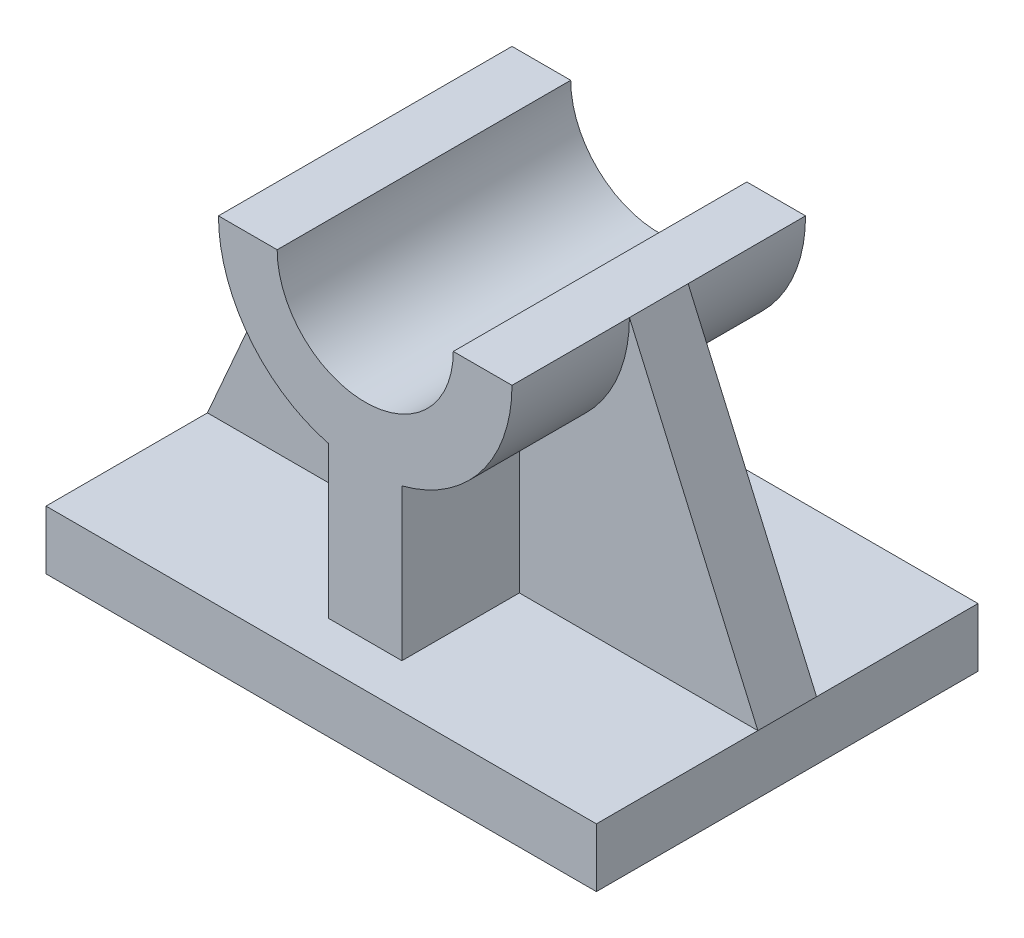
ISO-10303-21;
HEADER;
FILE_DESCRIPTION(('STEP AP214'),'2;1');
FILE_NAME('part.step','',(''),(''),'','','');
FILE_SCHEMA(('AUTOMOTIVE_DESIGN { 1 0 10303 214 1 1 1 1 }'));
ENDSEC;
DATA;
#1=APPLICATION_CONTEXT('core data for automotive mechanical design processes');
#2=APPLICATION_PROTOCOL_DEFINITION('international standard','automotive_design',2000,#1);
#3=PRODUCT_CONTEXT('',#1,'mechanical');
#4=PRODUCT('Part','Part','',(#3));
#5=PRODUCT_RELATED_PRODUCT_CATEGORY('part','',(#4));
#6=PRODUCT_DEFINITION_FORMATION('','',#4);
#7=PRODUCT_DEFINITION_CONTEXT('part definition',#1,'design');
#8=PRODUCT_DEFINITION('design','',#6,#7);
#9=PRODUCT_DEFINITION_SHAPE('','',#8);
#10=(LENGTH_UNIT() NAMED_UNIT(*) SI_UNIT(.MILLI.,.METRE.));
#11=(NAMED_UNIT(*) PLANE_ANGLE_UNIT() SI_UNIT($,.RADIAN.));
#12=(NAMED_UNIT(*) SI_UNIT($,.STERADIAN.) SOLID_ANGLE_UNIT());
#13=UNCERTAINTY_MEASURE_WITH_UNIT(LENGTH_MEASURE(1.E-05),#10,'distance_accuracy_value','');
#14=(GEOMETRIC_REPRESENTATION_CONTEXT(3) GLOBAL_UNCERTAINTY_ASSIGNED_CONTEXT((#13)) GLOBAL_UNIT_ASSIGNED_CONTEXT((#10,
#11,#12)) REPRESENTATION_CONTEXT('',''));
#15=CARTESIAN_POINT('',(0.,0.,0.));
#16=DIRECTION('',(0.,0.,1.));
#17=DIRECTION('',(1.,0.,0.));
#18=AXIS2_PLACEMENT_3D('',#15,#16,#17);
#19=CARTESIAN_POINT('',(-37.5,4.,26.));
#20=DIRECTION('',(0.,1.,0.));
#21=DIRECTION('',(-1.,0.,0.));
#22=AXIS2_PLACEMENT_3D('',#19,#20,#21);
#23=PLANE('',#22);
#24=DIRECTION('',(0.,0.,-1.));
#25=VECTOR('',#24,1.);
#26=CARTESIAN_POINT('',(-37.5,4.,26.));
#27=LINE('',#26,#25);
#28=CARTESIAN_POINT('',(-37.5,4.,-3.99999999999999));
#29=VERTEX_POINT('',#28);
#30=CARTESIAN_POINT('',(-37.5,4.,-26.));
#31=VERTEX_POINT('',#30);
#32=EDGE_CURVE('E46',#29,#31,#27,.T.);
#33=ORIENTED_EDGE('',*,*,#32,.F.);
#34=DIRECTION('',(1.,0.,0.));
#35=VECTOR('',#34,1.);
#36=CARTESIAN_POINT('',(-37.5,4.,-4.));
#37=LINE('',#36,#35);
#38=CARTESIAN_POINT('',(-5.,4.,-4.));
#39=VERTEX_POINT('',#38);
#40=EDGE_CURVE('E189',#29,#39,#37,.T.);
#41=ORIENTED_EDGE('',*,*,#40,.T.);
#42=DIRECTION('',(0.,0.,-1.));
#43=VECTOR('',#42,1.);
#44=CARTESIAN_POINT('',(-4.99999999999999,4.,20.));
#45=LINE('',#44,#43);
#46=CARTESIAN_POINT('',(-4.99999999999999,4.,-20.));
#47=VERTEX_POINT('',#46);
#48=EDGE_CURVE('E176',#39,#47,#45,.T.);
#49=ORIENTED_EDGE('',*,*,#48,.T.);
#50=DIRECTION('',(1.,0.,0.));
#51=VECTOR('',#50,1.);
#52=CARTESIAN_POINT('',(0.,4.,-20.));
#53=LINE('',#52,#51);
#54=CARTESIAN_POINT('',(5.,4.,-20.));
#55=VERTEX_POINT('',#54);
#56=EDGE_CURVE('E264',#47,#55,#53,.T.);
#57=ORIENTED_EDGE('',*,*,#56,.T.);
#58=DIRECTION('',(0.,0.,-1.));
#59=VECTOR('',#58,1.);
#60=CARTESIAN_POINT('',(5.,4.,20.));
#61=LINE('',#60,#59);
#62=CARTESIAN_POINT('',(5.,4.,-4.));
#63=VERTEX_POINT('',#62);
#64=EDGE_CURVE('E289',#63,#55,#61,.T.);
#65=ORIENTED_EDGE('',*,*,#64,.F.);
#66=DIRECTION('',(1.,0.,0.));
#67=VECTOR('',#66,1.);
#68=CARTESIAN_POINT('',(-37.5,4.,-4.));
#69=LINE('',#68,#67);
#70=CARTESIAN_POINT('',(37.5,3.99999999999998,-4.));
#71=VERTEX_POINT('',#70);
#72=EDGE_CURVE('E222',#63,#71,#69,.T.);
#73=ORIENTED_EDGE('',*,*,#72,.T.);
#74=DIRECTION('',(0.,0.,-1.));
#75=VECTOR('',#74,1.);
#76=CARTESIAN_POINT('',(37.5,4.,26.));
#77=LINE('',#76,#75);
#78=CARTESIAN_POINT('',(37.5,4.,-26.));
#79=VERTEX_POINT('',#78);
#80=EDGE_CURVE('E313',#71,#79,#77,.T.);
#81=ORIENTED_EDGE('',*,*,#80,.T.);
#82=DIRECTION('',(1.,0.,0.));
#83=VECTOR('',#82,1.);
#84=CARTESIAN_POINT('',(-37.5,4.,-26.));
#85=LINE('',#84,#83);
#86=EDGE_CURVE('E306',#31,#79,#85,.T.);
#87=ORIENTED_EDGE('',*,*,#86,.F.);
#88=EDGE_LOOP('',(#33,#41,#49,#57,#65,#73,#81,#87));
#89=FACE_BOUND('',#88,.T.);
#90=ADVANCED_FACE('F37',(#89),#23,.T.);
#91=CARTESIAN_POINT('',(0.,44.,20.));
#92=DIRECTION('',(0.,0.,-1.));
#93=DIRECTION('',(-1.,0.,0.));
#94=AXIS2_PLACEMENT_3D('',#91,#92,#93);
#95=CYLINDRICAL_SURFACE('',#94,20.);
#96=CARTESIAN_POINT('',(0.,44.,-4.));
#97=DIRECTION('',(0.,0.,1.));
#98=DIRECTION('',(1.,0.,0.));
#99=AXIS2_PLACEMENT_3D('',#96,#97,#98);
#100=CIRCLE('',#99,20.);
#101=CARTESIAN_POINT('',(-20.,44.,-4.));
#102=VERTEX_POINT('',#101);
#103=CARTESIAN_POINT('',(-5.,24.6350832689629,-4.));
#104=VERTEX_POINT('',#103);
#105=EDGE_CURVE('E197',#102,#104,#100,.T.);
#106=ORIENTED_EDGE('',*,*,#105,.F.);
#107=DIRECTION('',(0.,0.,-1.));
#108=VECTOR('',#107,1.);
#109=CARTESIAN_POINT('',(-20.,44.,20.));
#110=LINE('',#109,#108);
#111=CARTESIAN_POINT('',(-20.,44.,-20.));
#112=VERTEX_POINT('',#111);
#113=EDGE_CURVE('E296',#102,#112,#110,.T.);
#114=ORIENTED_EDGE('',*,*,#113,.T.);
#115=CARTESIAN_POINT('',(0.,44.,-20.));
#116=DIRECTION('',(0.,0.,1.));
#117=DIRECTION('',(1.,0.,0.));
#118=AXIS2_PLACEMENT_3D('',#115,#116,#117);
#119=CIRCLE('',#118,20.);
#120=CARTESIAN_POINT('',(-5.,24.6350832689629,-20.));
#121=VERTEX_POINT('',#120);
#122=EDGE_CURVE('E260',#112,#121,#119,.T.);
#123=ORIENTED_EDGE('',*,*,#122,.T.);
#124=DIRECTION('',(0.,0.,-1.));
#125=VECTOR('',#124,1.);
#126=CARTESIAN_POINT('',(-5.,24.6350832689629,20.));
#127=LINE('',#126,#125);
#128=EDGE_CURVE('E292',#104,#121,#127,.T.);
#129=ORIENTED_EDGE('',*,*,#128,.F.);
#130=EDGE_LOOP('',(#106,#114,#123,#129));
#131=FACE_BOUND('',#130,.T.);
#132=ADVANCED_FACE('F349',(#131),#95,.T.);
#133=CARTESIAN_POINT('',(-4.99999999999999,0.,20.));
#134=DIRECTION('',(1.,0.,0.));
#135=DIRECTION('',(0.,1.,0.));
#136=AXIS2_PLACEMENT_3D('',#133,#134,#135);
#137=PLANE('',#136);
#138=DIRECTION('',(0.,-1.,0.));
#139=VECTOR('',#138,1.);
#140=CARTESIAN_POINT('',(-4.99999999999999,0.,-4.));
#141=LINE('',#140,#139);
#142=EDGE_CURVE('E179',#104,#39,#141,.T.);
#143=ORIENTED_EDGE('',*,*,#142,.F.);
#144=ORIENTED_EDGE('',*,*,#128,.T.);
#145=DIRECTION('',(0.,-1.,0.));
#146=VECTOR('',#145,1.);
#147=CARTESIAN_POINT('',(-4.99999999999999,0.,-20.));
#148=LINE('',#147,#146);
#149=EDGE_CURVE('E182',#121,#47,#148,.T.);
#150=ORIENTED_EDGE('',*,*,#149,.T.);
#151=ORIENTED_EDGE('',*,*,#48,.F.);
#152=EDGE_LOOP('',(#143,#144,#150,#151));
#153=FACE_BOUND('',#152,.T.);
#154=ADVANCED_FACE('F177',(#153),#137,.F.);
#155=CARTESIAN_POINT('',(5.,0.,20.));
#156=DIRECTION('',(1.,0.,0.));
#157=DIRECTION('',(0.,1.,0.));
#158=AXIS2_PLACEMENT_3D('',#155,#156,#157);
#159=PLANE('',#158);
#160=DIRECTION('',(0.,0.,-1.));
#161=VECTOR('',#160,1.);
#162=CARTESIAN_POINT('',(5.,24.6350832689629,20.));
#163=LINE('',#162,#161);
#164=CARTESIAN_POINT('',(5.,24.6350832689629,-4.));
#165=VERTEX_POINT('',#164);
#166=CARTESIAN_POINT('',(5.,24.6350832689629,-20.));
#167=VERTEX_POINT('',#166);
#168=EDGE_CURVE('E284',#165,#167,#163,.T.);
#169=ORIENTED_EDGE('',*,*,#168,.F.);
#170=DIRECTION('',(0.,-1.,0.));
#171=VECTOR('',#170,1.);
#172=CARTESIAN_POINT('',(5.,0.,-4.));
#173=LINE('',#172,#171);
#174=EDGE_CURVE('E219',#165,#63,#173,.T.);
#175=ORIENTED_EDGE('',*,*,#174,.T.);
#176=ORIENTED_EDGE('',*,*,#64,.T.);
#177=DIRECTION('',(0.,-1.,0.));
#178=VECTOR('',#177,1.);
#179=CARTESIAN_POINT('',(5.,0.,-20.));
#180=LINE('',#179,#178);
#181=EDGE_CURVE('E266',#167,#55,#180,.T.);
#182=ORIENTED_EDGE('',*,*,#181,.F.);
#183=EDGE_LOOP('',(#169,#175,#176,#182));
#184=FACE_BOUND('',#183,.T.);
#185=ADVANCED_FACE('F367',(#184),#159,.T.);
#186=CARTESIAN_POINT('',(0.,44.,20.));
#187=DIRECTION('',(0.,0.,-1.));
#188=DIRECTION('',(-1.,0.,0.));
#189=AXIS2_PLACEMENT_3D('',#186,#187,#188);
#190=CYLINDRICAL_SURFACE('',#189,20.);
#191=CARTESIAN_POINT('',(0.,44.,-4.));
#192=DIRECTION('',(0.,0.,1.));
#193=DIRECTION('',(1.,0.,0.));
#194=AXIS2_PLACEMENT_3D('',#191,#192,#193);
#195=CIRCLE('',#194,20.);
#196=CARTESIAN_POINT('',(20.,44.,-4.));
#197=VERTEX_POINT('',#196);
#198=EDGE_CURVE('E214',#165,#197,#195,.T.);
#199=ORIENTED_EDGE('',*,*,#198,.F.);
#200=ORIENTED_EDGE('',*,*,#168,.T.);
#201=CARTESIAN_POINT('',(0.,44.,-20.));
#202=DIRECTION('',(0.,0.,1.));
#203=DIRECTION('',(1.,0.,0.));
#204=AXIS2_PLACEMENT_3D('',#201,#202,#203);
#205=CIRCLE('',#204,20.);
#206=CARTESIAN_POINT('',(20.,44.,-20.));
#207=VERTEX_POINT('',#206);
#208=EDGE_CURVE('E269',#167,#207,#205,.T.);
#209=ORIENTED_EDGE('',*,*,#208,.T.);
#210=DIRECTION('',(0.,0.,-1.));
#211=VECTOR('',#210,1.);
#212=CARTESIAN_POINT('',(20.,44.,20.));
#213=LINE('',#212,#211);
#214=EDGE_CURVE('E280',#197,#207,#213,.T.);
#215=ORIENTED_EDGE('',*,*,#214,.F.);
#216=EDGE_LOOP('',(#199,#200,#209,#215));
#217=FACE_BOUND('',#216,.T.);
#218=ADVANCED_FACE('F361',(#217),#190,.T.);
#219=DIRECTION('',(1.,0.,0.));
#220=VECTOR('',#219,1.);
#221=CARTESIAN_POINT('',(-37.5,4.,4.));
#222=LINE('',#221,#220);
#223=CARTESIAN_POINT('',(-37.5,4.,4.00000000000001));
#224=VERTEX_POINT('',#223);
#225=CARTESIAN_POINT('',(-4.99999999999999,4.,4.));
#226=VERTEX_POINT('',#225);
#227=EDGE_CURVE('E61',#224,#226,#222,.T.);
#228=ORIENTED_EDGE('',*,*,#227,.F.);
#229=CARTESIAN_POINT('',(-37.5,4.,26.));
#230=VERTEX_POINT('',#229);
#231=EDGE_CURVE('E11',#230,#224,#27,.T.);
#232=ORIENTED_EDGE('',*,*,#231,.F.);
#233=DIRECTION('',(1.,0.,0.));
#234=VECTOR('',#233,1.);
#235=CARTESIAN_POINT('',(-4.99999999999999,4.,26.));
#236=LINE('',#235,#234);
#237=CARTESIAN_POINT('',(37.5,4.,26.));
#238=VERTEX_POINT('',#237);
#239=EDGE_CURVE('E302',#230,#238,#236,.T.);
#240=ORIENTED_EDGE('',*,*,#239,.T.);
#241=CARTESIAN_POINT('',(37.5,3.99999999999998,4.));
#242=VERTEX_POINT('',#241);
#243=EDGE_CURVE('E41',#238,#242,#77,.T.);
#244=ORIENTED_EDGE('',*,*,#243,.T.);
#245=DIRECTION('',(1.,0.,0.));
#246=VECTOR('',#245,1.);
#247=CARTESIAN_POINT('',(-37.5,4.,4.));
#248=LINE('',#247,#246);
#249=CARTESIAN_POINT('',(5.,4.,4.));
#250=VERTEX_POINT('',#249);
#251=EDGE_CURVE('E230',#250,#242,#248,.T.);
#252=ORIENTED_EDGE('',*,*,#251,.F.);
#253=CARTESIAN_POINT('',(5.,4.,20.));
#254=VERTEX_POINT('',#253);
#255=EDGE_CURVE('E186',#254,#250,#61,.T.);
#256=ORIENTED_EDGE('',*,*,#255,.F.);
#257=DIRECTION('',(1.,0.,0.));
#258=VECTOR('',#257,1.);
#259=CARTESIAN_POINT('',(0.,4.,20.));
#260=LINE('',#259,#258);
#261=CARTESIAN_POINT('',(-4.99999999999999,4.,20.));
#262=VERTEX_POINT('',#261);
#263=EDGE_CURVE('E244',#262,#254,#260,.T.);
#264=ORIENTED_EDGE('',*,*,#263,.F.);
#265=EDGE_CURVE('E185',#262,#226,#45,.T.);
#266=ORIENTED_EDGE('',*,*,#265,.T.);
#267=EDGE_LOOP('',(#228,#232,#240,#244,#252,#256,#264,#266));
#268=FACE_BOUND('',#267,.T.);
#269=ADVANCED_FACE('F351',(#268),#23,.T.);
#270=CARTESIAN_POINT('',(-37.5,4.,26.));
#271=DIRECTION('',(1.,0.,0.));
#272=DIRECTION('',(0.,0.,-1.));
#273=AXIS2_PLACEMENT_3D('',#270,#271,#272);
#274=PLANE('',#273);
#275=ORIENTED_EDGE('',*,*,#231,.T.);
#276=DIRECTION('',(0.,0.,1.));
#277=VECTOR('',#276,1.);
#278=CARTESIAN_POINT('',(-37.5,4.,26.));
#279=LINE('',#278,#277);
#280=EDGE_CURVE('E207',#29,#224,#279,.T.);
#281=ORIENTED_EDGE('',*,*,#280,.F.);
#282=ORIENTED_EDGE('',*,*,#32,.T.);
#283=DIRECTION('',(0.,-1.,0.));
#284=VECTOR('',#283,1.);
#285=CARTESIAN_POINT('',(-37.5,4.,-26.));
#286=LINE('',#285,#284);
#287=CARTESIAN_POINT('',(-37.5,-4.,-26.));
#288=VERTEX_POINT('',#287);
#289=EDGE_CURVE('E319',#31,#288,#286,.T.);
#290=ORIENTED_EDGE('',*,*,#289,.T.);
#291=DIRECTION('',(0.,0.,-1.));
#292=VECTOR('',#291,1.);
#293=CARTESIAN_POINT('',(-37.5,-4.,26.));
#294=LINE('',#293,#292);
#295=CARTESIAN_POINT('',(-37.5,-4.,26.));
#296=VERTEX_POINT('',#295);
#297=EDGE_CURVE('E324',#296,#288,#294,.T.);
#298=ORIENTED_EDGE('',*,*,#297,.F.);
#299=DIRECTION('',(0.,-1.,0.));
#300=VECTOR('',#299,1.);
#301=CARTESIAN_POINT('',(-37.5,4.,26.));
#302=LINE('',#301,#300);
#303=EDGE_CURVE('E311',#230,#296,#302,.T.);
#304=ORIENTED_EDGE('',*,*,#303,.F.);
#305=EDGE_LOOP('',(#275,#281,#282,#290,#298,#304));
#306=FACE_BOUND('',#305,.T.);
#307=ADVANCED_FACE('F346',(#306),#274,.F.);
#308=CARTESIAN_POINT('',(-37.5,-4.,26.));
#309=DIRECTION('',(0.,1.,0.));
#310=DIRECTION('',(0.,0.,1.));
#311=AXIS2_PLACEMENT_3D('',#308,#309,#310);
#312=PLANE('',#311);
#313=ORIENTED_EDGE('',*,*,#297,.T.);
#314=DIRECTION('',(1.,0.,0.));
#315=VECTOR('',#314,1.);
#316=CARTESIAN_POINT('',(-37.5,-4.,-26.));
#317=LINE('',#316,#315);
#318=CARTESIAN_POINT('',(37.5,-4.,-26.));
#319=VERTEX_POINT('',#318);
#320=EDGE_CURVE('E316',#288,#319,#317,.T.);
#321=ORIENTED_EDGE('',*,*,#320,.T.);
#322=DIRECTION('',(0.,0.,-1.));
#323=VECTOR('',#322,1.);
#324=CARTESIAN_POINT('',(37.5,-4.,26.));
#325=LINE('',#324,#323);
#326=CARTESIAN_POINT('',(37.5,-4.,26.));
#327=VERTEX_POINT('',#326);
#328=EDGE_CURVE('E325',#327,#319,#325,.T.);
#329=ORIENTED_EDGE('',*,*,#328,.F.);
#330=DIRECTION('',(1.,0.,0.));
#331=VECTOR('',#330,1.);
#332=CARTESIAN_POINT('',(-37.5,-4.,26.));
#333=LINE('',#332,#331);
#334=EDGE_CURVE('E309',#296,#327,#333,.T.);
#335=ORIENTED_EDGE('',*,*,#334,.F.);
#336=EDGE_LOOP('',(#313,#321,#329,#335));
#337=FACE_BOUND('',#336,.T.);
#338=ADVANCED_FACE('F339',(#337),#312,.F.);
#339=CARTESIAN_POINT('',(37.5,4.,26.));
#340=DIRECTION('',(1.,0.,0.));
#341=DIRECTION('',(0.,1.,0.));
#342=AXIS2_PLACEMENT_3D('',#339,#340,#341);
#343=PLANE('',#342);
#344=ORIENTED_EDGE('',*,*,#328,.T.);
#345=DIRECTION('',(0.,-1.,0.));
#346=VECTOR('',#345,1.);
#347=CARTESIAN_POINT('',(37.5,4.,-26.));
#348=LINE('',#347,#346);
#349=EDGE_CURVE('E300',#79,#319,#348,.T.);
#350=ORIENTED_EDGE('',*,*,#349,.F.);
#351=ORIENTED_EDGE('',*,*,#80,.F.);
#352=DIRECTION('',(0.,0.,-1.));
#353=VECTOR('',#352,1.);
#354=CARTESIAN_POINT('',(37.5,3.99999999999999,26.));
#355=LINE('',#354,#353);
#356=EDGE_CURVE('E232',#71,#242,#355,.F.);
#357=ORIENTED_EDGE('',*,*,#356,.T.);
#358=ORIENTED_EDGE('',*,*,#243,.F.);
#359=DIRECTION('',(0.,-1.,0.));
#360=VECTOR('',#359,1.);
#361=CARTESIAN_POINT('',(37.5,4.,26.));
#362=LINE('',#361,#360);
#363=EDGE_CURVE('E305',#238,#327,#362,.T.);
#364=ORIENTED_EDGE('',*,*,#363,.T.);
#365=EDGE_LOOP('',(#344,#350,#351,#357,#358,#364));
#366=FACE_BOUND('',#365,.T.);
#367=ADVANCED_FACE('F39',(#366),#343,.T.);
#368=CARTESIAN_POINT('',(0.,0.,26.));
#369=DIRECTION('',(0.,0.,-1.));
#370=DIRECTION('',(-1.,0.,0.));
#371=AXIS2_PLACEMENT_3D('',#368,#369,#370);
#372=PLANE('',#371);
#373=ORIENTED_EDGE('',*,*,#239,.F.);
#374=ORIENTED_EDGE('',*,*,#303,.T.);
#375=ORIENTED_EDGE('',*,*,#334,.T.);
#376=ORIENTED_EDGE('',*,*,#363,.F.);
#377=EDGE_LOOP('',(#373,#374,#375,#376));
#378=FACE_BOUND('',#377,.T.);
#379=ADVANCED_FACE('F338',(#378),#372,.F.);
#380=CARTESIAN_POINT('',(0.,0.,-26.));
#381=DIRECTION('',(0.,0.,-1.));
#382=DIRECTION('',(-1.,0.,0.));
#383=AXIS2_PLACEMENT_3D('',#380,#381,#382);
#384=PLANE('',#383);
#385=ORIENTED_EDGE('',*,*,#86,.T.);
#386=ORIENTED_EDGE('',*,*,#349,.T.);
#387=ORIENTED_EDGE('',*,*,#320,.F.);
#388=ORIENTED_EDGE('',*,*,#289,.F.);
#389=EDGE_LOOP('',(#385,#386,#387,#388));
#390=FACE_BOUND('',#389,.T.);
#391=ADVANCED_FACE('F335',(#390),#384,.T.);
#392=CARTESIAN_POINT('',(0.,44.,20.));
#393=DIRECTION('',(0.,-1.,0.));
#394=DIRECTION('',(0.,0.,-1.));
#395=AXIS2_PLACEMENT_3D('',#392,#393,#394);
#396=PLANE('',#395);
#397=DIRECTION('',(0.,0.,-1.));
#398=VECTOR('',#397,1.);
#399=CARTESIAN_POINT('',(-12.,44.,20.));
#400=LINE('',#399,#398);
#401=CARTESIAN_POINT('',(-12.,44.,20.));
#402=VERTEX_POINT('',#401);
#403=CARTESIAN_POINT('',(-12.,44.,-20.));
#404=VERTEX_POINT('',#403);
#405=EDGE_CURVE('E257',#402,#404,#400,.T.);
#406=ORIENTED_EDGE('',*,*,#405,.T.);
#407=DIRECTION('',(-1.,0.,0.));
#408=VECTOR('',#407,1.);
#409=CARTESIAN_POINT('',(0.,44.,-20.));
#410=LINE('',#409,#408);
#411=EDGE_CURVE('E235',#404,#112,#410,.T.);
#412=ORIENTED_EDGE('',*,*,#411,.T.);
#413=ORIENTED_EDGE('',*,*,#113,.F.);
#414=CARTESIAN_POINT('',(-20.,44.,4.));
#415=VERTEX_POINT('',#414);
#416=EDGE_CURVE('E301',#415,#102,#110,.T.);
#417=ORIENTED_EDGE('',*,*,#416,.F.);
#418=CARTESIAN_POINT('',(-20.,44.,20.));
#419=VERTEX_POINT('',#418);
#420=EDGE_CURVE('E297',#419,#415,#110,.T.);
#421=ORIENTED_EDGE('',*,*,#420,.F.);
#422=DIRECTION('',(-1.,0.,0.));
#423=VECTOR('',#422,1.);
#424=CARTESIAN_POINT('',(0.,44.,20.));
#425=LINE('',#424,#423);
#426=EDGE_CURVE('E236',#402,#419,#425,.T.);
#427=ORIENTED_EDGE('',*,*,#426,.F.);
#428=EDGE_LOOP('',(#406,#412,#413,#417,#421,#427));
#429=FACE_BOUND('',#428,.T.);
#430=ADVANCED_FACE('F424',(#429),#396,.F.);
#431=ORIENTED_EDGE('',*,*,#420,.T.);
#432=CARTESIAN_POINT('',(0.,44.,4.));
#433=DIRECTION('',(0.,0.,1.));
#434=DIRECTION('',(1.,0.,0.));
#435=AXIS2_PLACEMENT_3D('',#432,#433,#434);
#436=CIRCLE('',#435,20.);
#437=CARTESIAN_POINT('',(-5.,24.6350832689629,4.));
#438=VERTEX_POINT('',#437);
#439=EDGE_CURVE('E205',#415,#438,#436,.T.);
#440=ORIENTED_EDGE('',*,*,#439,.T.);
#441=CARTESIAN_POINT('',(-5.,24.6350832689629,20.));
#442=VERTEX_POINT('',#441);
#443=EDGE_CURVE('E293',#442,#438,#127,.T.);
#444=ORIENTED_EDGE('',*,*,#443,.F.);
#445=CARTESIAN_POINT('',(0.,44.,20.));
#446=DIRECTION('',(0.,0.,1.));
#447=DIRECTION('',(1.,0.,0.));
#448=AXIS2_PLACEMENT_3D('',#445,#446,#447);
#449=CIRCLE('',#448,20.);
#450=EDGE_CURVE('E239',#419,#442,#449,.T.);
#451=ORIENTED_EDGE('',*,*,#450,.F.);
#452=EDGE_LOOP('',(#431,#440,#444,#451));
#453=FACE_BOUND('',#452,.T.);
#454=ADVANCED_FACE('F357',(#453),#95,.T.);
#455=ORIENTED_EDGE('',*,*,#443,.T.);
#456=DIRECTION('',(0.,-1.,0.));
#457=VECTOR('',#456,1.);
#458=CARTESIAN_POINT('',(-4.99999999999999,0.,4.));
#459=LINE('',#458,#457);
#460=EDGE_CURVE('E203',#438,#226,#459,.T.);
#461=ORIENTED_EDGE('',*,*,#460,.T.);
#462=ORIENTED_EDGE('',*,*,#265,.F.);
#463=DIRECTION('',(0.,-1.,0.));
#464=VECTOR('',#463,1.);
#465=CARTESIAN_POINT('',(-4.99999999999999,0.,20.));
#466=LINE('',#465,#464);
#467=EDGE_CURVE('E242',#442,#262,#466,.T.);
#468=ORIENTED_EDGE('',*,*,#467,.F.);
#469=EDGE_LOOP('',(#455,#461,#462,#468));
#470=FACE_BOUND('',#469,.T.);
#471=ADVANCED_FACE('F388',(#470),#137,.F.);
#472=DIRECTION('',(0.,-1.,0.));
#473=VECTOR('',#472,1.);
#474=CARTESIAN_POINT('',(5.,0.,4.));
#475=LINE('',#474,#473);
#476=CARTESIAN_POINT('',(5.,24.6350832689629,4.));
#477=VERTEX_POINT('',#476);
#478=EDGE_CURVE('E228',#477,#250,#475,.T.);
#479=ORIENTED_EDGE('',*,*,#478,.F.);
#480=CARTESIAN_POINT('',(5.,24.6350832689629,20.));
#481=VERTEX_POINT('',#480);
#482=EDGE_CURVE('E286',#481,#477,#163,.T.);
#483=ORIENTED_EDGE('',*,*,#482,.F.);
#484=DIRECTION('',(0.,-1.,0.));
#485=VECTOR('',#484,1.);
#486=CARTESIAN_POINT('',(5.,0.,20.));
#487=LINE('',#486,#485);
#488=EDGE_CURVE('E246',#481,#254,#487,.T.);
#489=ORIENTED_EDGE('',*,*,#488,.T.);
#490=ORIENTED_EDGE('',*,*,#255,.T.);
#491=EDGE_LOOP('',(#479,#483,#489,#490));
#492=FACE_BOUND('',#491,.T.);
#493=ADVANCED_FACE('F376',(#492),#159,.T.);
#494=ORIENTED_EDGE('',*,*,#482,.T.);
#495=CARTESIAN_POINT('',(0.,44.,4.));
#496=DIRECTION('',(0.,0.,1.));
#497=DIRECTION('',(1.,0.,0.));
#498=AXIS2_PLACEMENT_3D('',#495,#496,#497);
#499=CIRCLE('',#498,20.);
#500=CARTESIAN_POINT('',(20.,44.,4.));
#501=VERTEX_POINT('',#500);
#502=EDGE_CURVE('E225',#477,#501,#499,.T.);
#503=ORIENTED_EDGE('',*,*,#502,.T.);
#504=CARTESIAN_POINT('',(20.,44.,20.));
#505=VERTEX_POINT('',#504);
#506=EDGE_CURVE('E281',#505,#501,#213,.T.);
#507=ORIENTED_EDGE('',*,*,#506,.F.);
#508=CARTESIAN_POINT('',(0.,44.,20.));
#509=DIRECTION('',(0.,0.,1.));
#510=DIRECTION('',(1.,0.,0.));
#511=AXIS2_PLACEMENT_3D('',#508,#509,#510);
#512=CIRCLE('',#511,20.);
#513=EDGE_CURVE('E249',#481,#505,#512,.T.);
#514=ORIENTED_EDGE('',*,*,#513,.F.);
#515=EDGE_LOOP('',(#494,#503,#507,#514));
#516=FACE_BOUND('',#515,.T.);
#517=ADVANCED_FACE('F370',(#516),#190,.T.);
#518=CARTESIAN_POINT('',(0.,44.,20.));
#519=DIRECTION('',(0.,1.,0.));
#520=DIRECTION('',(-1.,0.,0.));
#521=AXIS2_PLACEMENT_3D('',#518,#519,#520);
#522=PLANE('',#521);
#523=ORIENTED_EDGE('',*,*,#506,.T.);
#524=EDGE_CURVE('E285',#501,#197,#213,.T.);
#525=ORIENTED_EDGE('',*,*,#524,.T.);
#526=ORIENTED_EDGE('',*,*,#214,.T.);
#527=DIRECTION('',(1.,0.,0.));
#528=VECTOR('',#527,1.);
#529=CARTESIAN_POINT('',(0.,44.,-20.));
#530=LINE('',#529,#528);
#531=CARTESIAN_POINT('',(12.,44.,-20.));
#532=VERTEX_POINT('',#531);
#533=EDGE_CURVE('E272',#532,#207,#530,.T.);
#534=ORIENTED_EDGE('',*,*,#533,.F.);
#535=DIRECTION('',(0.,0.,-1.));
#536=VECTOR('',#535,1.);
#537=CARTESIAN_POINT('',(12.,44.,20.));
#538=LINE('',#537,#536);
#539=CARTESIAN_POINT('',(12.,44.,20.));
#540=VERTEX_POINT('',#539);
#541=EDGE_CURVE('E278',#540,#532,#538,.T.);
#542=ORIENTED_EDGE('',*,*,#541,.F.);
#543=DIRECTION('',(1.,0.,0.));
#544=VECTOR('',#543,1.);
#545=CARTESIAN_POINT('',(0.,44.,20.));
#546=LINE('',#545,#544);
#547=EDGE_CURVE('E251',#540,#505,#546,.T.);
#548=ORIENTED_EDGE('',*,*,#547,.T.);
#549=EDGE_LOOP('',(#523,#525,#526,#534,#542,#548));
#550=FACE_BOUND('',#549,.T.);
#551=ADVANCED_FACE('F380',(#550),#522,.T.);
#552=CARTESIAN_POINT('',(0.,44.,20.));
#553=DIRECTION('',(0.,0.,-1.));
#554=DIRECTION('',(-1.,0.,0.));
#555=AXIS2_PLACEMENT_3D('',#552,#553,#554);
#556=CYLINDRICAL_SURFACE('',#555,12.);
#557=ORIENTED_EDGE('',*,*,#541,.T.);
#558=CARTESIAN_POINT('',(0.,44.,-20.));
#559=DIRECTION('',(0.,0.,1.));
#560=DIRECTION('',(1.,0.,0.));
#561=AXIS2_PLACEMENT_3D('',#558,#559,#560);
#562=CIRCLE('',#561,12.);
#563=EDGE_CURVE('E240',#404,#532,#562,.T.);
#564=ORIENTED_EDGE('',*,*,#563,.F.);
#565=ORIENTED_EDGE('',*,*,#405,.F.);
#566=CARTESIAN_POINT('',(0.,44.,20.));
#567=DIRECTION('',(0.,0.,1.));
#568=DIRECTION('',(1.,0.,0.));
#569=AXIS2_PLACEMENT_3D('',#566,#567,#568);
#570=CIRCLE('',#569,12.);
#571=EDGE_CURVE('E254',#402,#540,#570,.T.);
#572=ORIENTED_EDGE('',*,*,#571,.T.);
#573=EDGE_LOOP('',(#557,#564,#565,#572));
#574=FACE_BOUND('',#573,.T.);
#575=ADVANCED_FACE('F386',(#574),#556,.F.);
#576=CARTESIAN_POINT('',(0.,0.,20.));
#577=DIRECTION('',(0.,0.,1.));
#578=DIRECTION('',(1.,0.,0.));
#579=AXIS2_PLACEMENT_3D('',#576,#577,#578);
#580=PLANE('',#579);
#581=ORIENTED_EDGE('',*,*,#426,.T.);
#582=ORIENTED_EDGE('',*,*,#450,.T.);
#583=ORIENTED_EDGE('',*,*,#467,.T.);
#584=ORIENTED_EDGE('',*,*,#263,.T.);
#585=ORIENTED_EDGE('',*,*,#488,.F.);
#586=ORIENTED_EDGE('',*,*,#513,.T.);
#587=ORIENTED_EDGE('',*,*,#547,.F.);
#588=ORIENTED_EDGE('',*,*,#571,.F.);
#589=EDGE_LOOP('',(#581,#582,#583,#584,#585,#586,#587,#588));
#590=FACE_BOUND('',#589,.T.);
#591=ADVANCED_FACE('F401',(#590),#580,.T.);
#592=CARTESIAN_POINT('',(0.,0.,-20.));
#593=DIRECTION('',(0.,0.,1.));
#594=DIRECTION('',(1.,0.,0.));
#595=AXIS2_PLACEMENT_3D('',#592,#593,#594);
#596=PLANE('',#595);
#597=ORIENTED_EDGE('',*,*,#411,.F.);
#598=ORIENTED_EDGE('',*,*,#563,.T.);
#599=ORIENTED_EDGE('',*,*,#533,.T.);
#600=ORIENTED_EDGE('',*,*,#208,.F.);
#601=ORIENTED_EDGE('',*,*,#181,.T.);
#602=ORIENTED_EDGE('',*,*,#56,.F.);
#603=ORIENTED_EDGE('',*,*,#149,.F.);
#604=ORIENTED_EDGE('',*,*,#122,.F.);
#605=EDGE_LOOP('',(#597,#598,#599,#600,#601,#602,#603,#604));
#606=FACE_BOUND('',#605,.T.);
#607=ADVANCED_FACE('F422',(#606),#596,.F.);
#608=CARTESIAN_POINT('',(20.,44.,0.));
#609=DIRECTION('',(-0.916157334902189,-0.400818834019708,0.));
#610=DIRECTION('',(0.400818834019708,-0.916157334902189,0.));
#611=AXIS2_PLACEMENT_3D('',#608,#609,#610);
#612=PLANE('',#611);
#613=ORIENTED_EDGE('',*,*,#356,.F.);
#614=DIRECTION('',(0.400818834019708,-0.916157334902189,0.));
#615=VECTOR('',#614,1.);
#616=CARTESIAN_POINT('',(20.,44.,-4.));
#617=LINE('',#616,#615);
#618=EDGE_CURVE('E210',#197,#71,#617,.T.);
#619=ORIENTED_EDGE('',*,*,#618,.F.);
#620=ORIENTED_EDGE('',*,*,#524,.F.);
#621=DIRECTION('',(0.400818834019708,-0.916157334902189,0.));
#622=VECTOR('',#621,1.);
#623=CARTESIAN_POINT('',(20.,44.,4.));
#624=LINE('',#623,#622);
#625=EDGE_CURVE('E211',#501,#242,#624,.T.);
#626=ORIENTED_EDGE('',*,*,#625,.T.);
#627=EDGE_LOOP('',(#613,#619,#620,#626));
#628=FACE_BOUND('',#627,.T.);
#629=ADVANCED_FACE('F438',(#628),#612,.F.);
#630=CARTESIAN_POINT('',(0.,20.,4.));
#631=DIRECTION('',(0.,0.,1.));
#632=DIRECTION('',(1.,0.,0.));
#633=AXIS2_PLACEMENT_3D('',#630,#631,#632);
#634=PLANE('',#633);
#635=ORIENTED_EDGE('',*,*,#478,.T.);
#636=ORIENTED_EDGE('',*,*,#251,.T.);
#637=ORIENTED_EDGE('',*,*,#625,.F.);
#638=ORIENTED_EDGE('',*,*,#502,.F.);
#639=EDGE_LOOP('',(#635,#636,#637,#638));
#640=FACE_BOUND('',#639,.T.);
#641=ADVANCED_FACE('F396',(#640),#634,.T.);
#642=CARTESIAN_POINT('',(0.,20.,-4.));
#643=DIRECTION('',(0.,0.,1.));
#644=DIRECTION('',(1.,0.,0.));
#645=AXIS2_PLACEMENT_3D('',#642,#643,#644);
#646=PLANE('',#645);
#647=ORIENTED_EDGE('',*,*,#72,.F.);
#648=ORIENTED_EDGE('',*,*,#174,.F.);
#649=ORIENTED_EDGE('',*,*,#198,.T.);
#650=ORIENTED_EDGE('',*,*,#618,.T.);
#651=EDGE_LOOP('',(#647,#648,#649,#650));
#652=FACE_BOUND('',#651,.T.);
#653=ADVANCED_FACE('F436',(#652),#646,.F.);
#654=CARTESIAN_POINT('',(-20.,44.,0.));
#655=DIRECTION('',(-0.916157334902189,0.400818834019708,0.));
#656=DIRECTION('',(-0.400818834019708,-0.916157334902189,0.));
#657=AXIS2_PLACEMENT_3D('',#654,#655,#656);
#658=PLANE('',#657);
#659=DIRECTION('',(-0.400818834019708,-0.916157334902189,0.));
#660=VECTOR('',#659,1.);
#661=CARTESIAN_POINT('',(-20.,44.,-4.));
#662=LINE('',#661,#660);
#663=EDGE_CURVE('E413',#102,#29,#662,.T.);
#664=ORIENTED_EDGE('',*,*,#663,.T.);
#665=ORIENTED_EDGE('',*,*,#280,.T.);
#666=DIRECTION('',(-0.400818834019708,-0.916157334902189,0.));
#667=VECTOR('',#666,1.);
#668=CARTESIAN_POINT('',(-20.,44.,4.));
#669=LINE('',#668,#667);
#670=EDGE_CURVE('E193',#415,#224,#669,.T.);
#671=ORIENTED_EDGE('',*,*,#670,.F.);
#672=ORIENTED_EDGE('',*,*,#416,.T.);
#673=EDGE_LOOP('',(#664,#665,#671,#672));
#674=FACE_BOUND('',#673,.T.);
#675=ADVANCED_FACE('F415',(#674),#658,.T.);
#676=CARTESIAN_POINT('',(0.,20.,4.));
#677=DIRECTION('',(0.,0.,1.));
#678=DIRECTION('',(1.,0.,0.));
#679=AXIS2_PLACEMENT_3D('',#676,#677,#678);
#680=PLANE('',#679);
#681=ORIENTED_EDGE('',*,*,#439,.F.);
#682=ORIENTED_EDGE('',*,*,#670,.T.);
#683=ORIENTED_EDGE('',*,*,#227,.T.);
#684=ORIENTED_EDGE('',*,*,#460,.F.);
#685=EDGE_LOOP('',(#681,#682,#683,#684));
#686=FACE_BOUND('',#685,.T.);
#687=ADVANCED_FACE('F408',(#686),#680,.T.);
#688=CARTESIAN_POINT('',(0.,20.,-4.));
#689=DIRECTION('',(0.,0.,1.));
#690=DIRECTION('',(1.,0.,0.));
#691=AXIS2_PLACEMENT_3D('',#688,#689,#690);
#692=PLANE('',#691);
#693=ORIENTED_EDGE('',*,*,#663,.F.);
#694=ORIENTED_EDGE('',*,*,#105,.T.);
#695=ORIENTED_EDGE('',*,*,#142,.T.);
#696=ORIENTED_EDGE('',*,*,#40,.F.);
#697=EDGE_LOOP('',(#693,#694,#695,#696));
#698=FACE_BOUND('',#697,.T.);
#699=ADVANCED_FACE('F196',(#698),#692,.F.);
#700=CLOSED_SHELL('',(#90,#132,#154,#185,#218,#269,#307,#338,#367,#379,#391,#430,#454,#471,#493,
#517,#551,#575,#591,#607,#629,#641,#653,#675,#687,#699));
#701=MANIFOLD_SOLID_BREP('B2',#700);
#702=ADVANCED_BREP_SHAPE_REPRESENTATION('',(#18,#701),#14);
#703=SHAPE_DEFINITION_REPRESENTATION(#9,#702);
ENDSEC;
END-ISO-10303-21;
